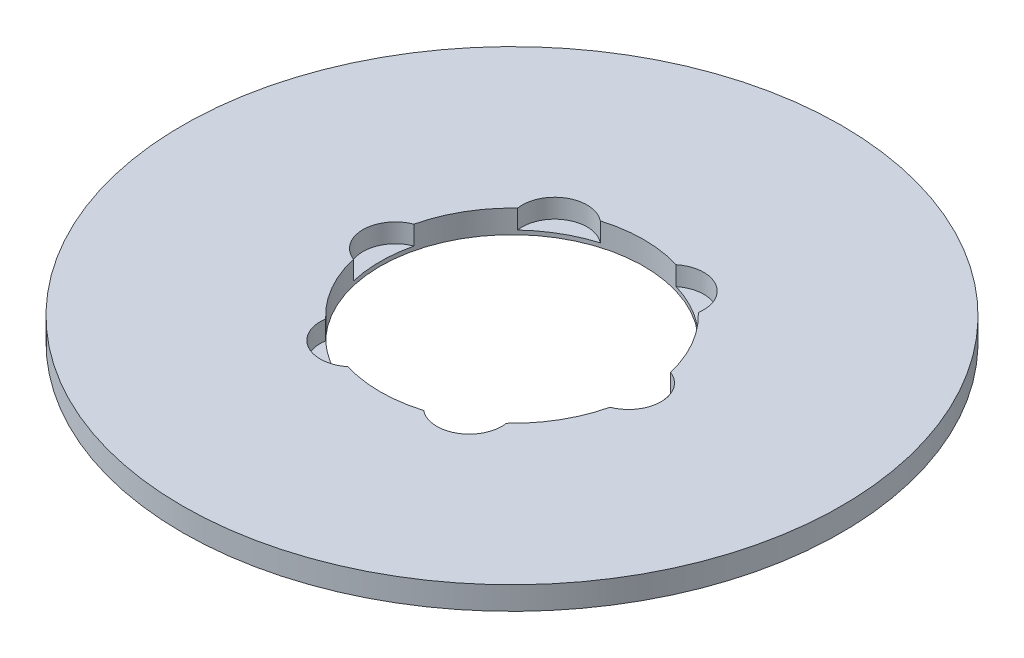
ISO-10303-21;
HEADER;
FILE_DESCRIPTION(('STEP AP214'),'2;1');
FILE_NAME('part.step','',(''),(''),'','','');
FILE_SCHEMA(('AUTOMOTIVE_DESIGN { 1 0 10303 214 1 1 1 1 }'));
ENDSEC;
DATA;
#1=APPLICATION_CONTEXT('core data for automotive mechanical design processes');
#2=APPLICATION_PROTOCOL_DEFINITION('international standard','automotive_design',2000,#1);
#3=PRODUCT_CONTEXT('',#1,'mechanical');
#4=PRODUCT('Part','Part','',(#3));
#5=PRODUCT_RELATED_PRODUCT_CATEGORY('part','',(#4));
#6=PRODUCT_DEFINITION_FORMATION('','',#4);
#7=PRODUCT_DEFINITION_CONTEXT('part definition',#1,'design');
#8=PRODUCT_DEFINITION('design','',#6,#7);
#9=PRODUCT_DEFINITION_SHAPE('','',#8);
#10=(LENGTH_UNIT() NAMED_UNIT(*) SI_UNIT(.MILLI.,.METRE.));
#11=(NAMED_UNIT(*) PLANE_ANGLE_UNIT() SI_UNIT($,.RADIAN.));
#12=(NAMED_UNIT(*) SI_UNIT($,.STERADIAN.) SOLID_ANGLE_UNIT());
#13=UNCERTAINTY_MEASURE_WITH_UNIT(LENGTH_MEASURE(1.E-05),#10,'distance_accuracy_value','');
#14=(GEOMETRIC_REPRESENTATION_CONTEXT(3) GLOBAL_UNCERTAINTY_ASSIGNED_CONTEXT((#13)) GLOBAL_UNIT_ASSIGNED_CONTEXT((#10,
#11,#12)) REPRESENTATION_CONTEXT('',''));
#15=CARTESIAN_POINT('',(0.,0.,0.));
#16=DIRECTION('',(0.,0.,1.));
#17=DIRECTION('',(1.,0.,0.));
#18=AXIS2_PLACEMENT_3D('',#15,#16,#17);
#19=CARTESIAN_POINT('',(0.,7.,0.));
#20=DIRECTION('',(0.,-1.,0.));
#21=DIRECTION('',(0.,0.,-1.));
#22=AXIS2_PLACEMENT_3D('',#19,#20,#21);
#23=CYLINDRICAL_SURFACE('',#22,100.);
#24=CARTESIAN_POINT('',(0.,7.,0.));
#25=DIRECTION('',(0.,1.,0.));
#26=DIRECTION('',(0.,0.,1.));
#27=AXIS2_PLACEMENT_3D('',#24,#25,#26);
#28=CIRCLE('',#27,100.);
#29=CARTESIAN_POINT('',(0.,7.,100.));
#30=VERTEX_POINT('',#29);
#31=EDGE_CURVE('E162',#30,#30,#28,.T.);
#32=ORIENTED_EDGE('',*,*,#31,.F.);
#33=EDGE_LOOP('',(#32));
#34=FACE_BOUND('',#33,.T.);
#35=CARTESIAN_POINT('',(0.,0.,0.));
#36=DIRECTION('',(0.,1.,0.));
#37=DIRECTION('',(0.,0.,1.));
#38=AXIS2_PLACEMENT_3D('',#35,#36,#37);
#39=CIRCLE('',#38,100.);
#40=CARTESIAN_POINT('',(0.,0.,100.));
#41=VERTEX_POINT('',#40);
#42=EDGE_CURVE('E157',#41,#41,#39,.T.);
#43=ORIENTED_EDGE('',*,*,#42,.T.);
#44=EDGE_LOOP('',(#43));
#45=FACE_BOUND('',#44,.T.);
#46=ADVANCED_FACE('F39',(#34,#45),#23,.T.);
#47=CARTESIAN_POINT('',(0.,7.,0.));
#48=DIRECTION('',(0.,1.,0.));
#49=DIRECTION('',(0.,0.,1.));
#50=AXIS2_PLACEMENT_3D('',#47,#48,#49);
#51=PLANE('',#50);
#52=CARTESIAN_POINT('',(-17.6937887469157,7.,-30.6465410880476));
#53=DIRECTION('',(0.,1.,0.));
#54=DIRECTION('',(-0.866025403784433,0.,0.50000000000001));
#55=AXIS2_PLACEMENT_3D('',#52,#53,#54);
#56=CIRCLE('',#55,9.84635689659921);
#57=CARTESIAN_POINT('',(-11.5094024887919,7.,-38.3084018767553));
#58=VERTEX_POINT('',#57);
#59=CARTESIAN_POINT('',(-27.4213479592583,7.,-29.1216358760507));
#60=VERTEX_POINT('',#59);
#61=EDGE_CURVE('E218',#58,#60,#56,.T.);
#62=ORIENTED_EDGE('',*,*,#61,.F.);
#63=CARTESIAN_POINT('',(0.,7.,0.));
#64=DIRECTION('',(0.,1.,0.));
#65=DIRECTION('',(0.,0.,1.));
#66=AXIS2_PLACEMENT_3D('',#63,#64,#65);
#67=CIRCLE('',#66,40.);
#68=CARTESIAN_POINT('',(11.5094024887911,7.,-38.3084018767555));
#69=VERTEX_POINT('',#68);
#70=EDGE_CURVE('E169',#69,#58,#67,.T.);
#71=ORIENTED_EDGE('',*,*,#70,.F.);
#72=CARTESIAN_POINT('',(17.693788746915,7.,-30.6465410880479));
#73=DIRECTION('',(0.,1.,0.));
#74=DIRECTION('',(-0.866025403784443,0.,-0.499999999999992));
#75=AXIS2_PLACEMENT_3D('',#72,#73,#74);
#76=CIRCLE('',#75,9.84635689659921);
#77=CARTESIAN_POINT('',(27.4213479592577,7.,-29.1216358760513));
#78=VERTEX_POINT('',#77);
#79=EDGE_CURVE('E285',#78,#69,#76,.T.);
#80=ORIENTED_EDGE('',*,*,#79,.F.);
#81=CARTESIAN_POINT('',(38.9307504480494,7.,-9.18676600070445));
#82=VERTEX_POINT('',#81);
#83=EDGE_CURVE('E174',#82,#78,#67,.T.);
#84=ORIENTED_EDGE('',*,*,#83,.F.);
#85=CARTESIAN_POINT('',(35.3875774938306,7.,0.));
#86=DIRECTION('',(0.,1.,0.));
#87=DIRECTION('',(0.,0.,-1.));
#88=AXIS2_PLACEMENT_3D('',#85,#86,#87);
#89=CIRCLE('',#88,9.84635689659921);
#90=CARTESIAN_POINT('',(38.9307504480494,7.,9.18676600070445));
#91=VERTEX_POINT('',#90);
#92=EDGE_CURVE('E280',#91,#82,#89,.T.);
#93=ORIENTED_EDGE('',*,*,#92,.F.);
#94=CARTESIAN_POINT('',(27.4213479592581,7.,29.1216358760509));
#95=VERTEX_POINT('',#94);
#96=EDGE_CURVE('E164',#95,#91,#67,.T.);
#97=ORIENTED_EDGE('',*,*,#96,.F.);
#98=CARTESIAN_POINT('',(17.6937887469155,7.,30.6465410880477));
#99=DIRECTION('',(0.,1.,0.));
#100=DIRECTION('',(0.866025403784436,0.,-0.500000000000004));
#101=AXIS2_PLACEMENT_3D('',#98,#99,#100);
#102=CIRCLE('',#101,9.84635689659921);
#103=CARTESIAN_POINT('',(11.5094024887917,7.,38.3084018767554));
#104=VERTEX_POINT('',#103);
#105=EDGE_CURVE('E269',#104,#95,#102,.T.);
#106=ORIENTED_EDGE('',*,*,#105,.F.);
#107=CARTESIAN_POINT('',(-11.5094024887914,7.,38.3084018767555));
#108=VERTEX_POINT('',#107);
#109=EDGE_CURVE('E149',#108,#104,#67,.T.);
#110=ORIENTED_EDGE('',*,*,#109,.F.);
#111=CARTESIAN_POINT('',(-17.6937887469152,7.,30.6465410880478));
#112=DIRECTION('',(0.,1.,0.));
#113=DIRECTION('',(0.86602540378444,0.,0.499999999999998));
#114=AXIS2_PLACEMENT_3D('',#111,#112,#113);
#115=CIRCLE('',#114,9.84635689659921);
#116=CARTESIAN_POINT('',(-27.4213479592579,7.,29.1216358760511));
#117=VERTEX_POINT('',#116);
#118=EDGE_CURVE('E128',#117,#108,#115,.T.);
#119=ORIENTED_EDGE('',*,*,#118,.F.);
#120=CARTESIAN_POINT('',(-38.9307504480494,7.,9.18676600070445));
#121=VERTEX_POINT('',#120);
#122=EDGE_CURVE('E148',#121,#117,#67,.T.);
#123=ORIENTED_EDGE('',*,*,#122,.F.);
#124=CARTESIAN_POINT('',(-35.3875774938306,7.,0.));
#125=DIRECTION('',(0.,1.,0.));
#126=DIRECTION('',(0.,0.,1.));
#127=AXIS2_PLACEMENT_3D('',#124,#125,#126);
#128=CIRCLE('',#127,9.84635689659921);
#129=CARTESIAN_POINT('',(-38.9307504480494,7.,-9.18676600070445));
#130=VERTEX_POINT('',#129);
#131=EDGE_CURVE('E179',#130,#121,#128,.T.);
#132=ORIENTED_EDGE('',*,*,#131,.F.);
#133=EDGE_CURVE('E161',#60,#130,#67,.T.);
#134=ORIENTED_EDGE('',*,*,#133,.F.);
#135=EDGE_LOOP('',(#62,#71,#80,#84,#93,#97,#106,#110,#119,#123,#132,#134));
#136=FACE_BOUND('',#135,.T.);
#137=ORIENTED_EDGE('',*,*,#31,.T.);
#138=EDGE_LOOP('',(#137));
#139=FACE_BOUND('',#138,.T.);
#140=ADVANCED_FACE('F141',(#136,#139),#51,.T.);
#141=CARTESIAN_POINT('',(0.,0.,0.));
#142=DIRECTION('',(0.,1.,0.));
#143=DIRECTION('',(0.,0.,1.));
#144=AXIS2_PLACEMENT_3D('',#141,#142,#143);
#145=PLANE('',#144);
#146=CARTESIAN_POINT('',(0.,0.,0.));
#147=DIRECTION('',(0.,1.,0.));
#148=DIRECTION('',(0.,0.,1.));
#149=AXIS2_PLACEMENT_3D('',#146,#147,#148);
#150=CIRCLE('',#149,40.);
#151=CARTESIAN_POINT('',(0.,0.,40.));
#152=VERTEX_POINT('',#151);
#153=EDGE_CURVE('E166',#152,#152,#150,.T.);
#154=ORIENTED_EDGE('',*,*,#153,.T.);
#155=EDGE_LOOP('',(#154));
#156=FACE_BOUND('',#155,.T.);
#157=ORIENTED_EDGE('',*,*,#42,.F.);
#158=EDGE_LOOP('',(#157));
#159=FACE_BOUND('',#158,.T.);
#160=ADVANCED_FACE('F234',(#156,#159),#145,.F.);
#161=CARTESIAN_POINT('',(0.,7.,0.));
#162=DIRECTION('',(0.,-1.,0.));
#163=DIRECTION('',(0.,0.,-1.));
#164=AXIS2_PLACEMENT_3D('',#161,#162,#163);
#165=CYLINDRICAL_SURFACE('',#164,40.);
#166=DIRECTION('',(0.,1.,0.));
#167=VECTOR('',#166,1.);
#168=CARTESIAN_POINT('',(-11.5094024887919,4.11774363589158,-38.3084018767553));
#169=LINE('',#168,#167);
#170=CARTESIAN_POINT('',(-11.5094024887919,1.23548727178315,-38.3084018767553));
#171=VERTEX_POINT('',#170);
#172=EDGE_CURVE('E11',#171,#58,#169,.T.);
#173=ORIENTED_EDGE('',*,*,#172,.F.);
#174=CARTESIAN_POINT('',(0.,1.23548727178315,0.));
#175=DIRECTION('',(0.,1.,0.));
#176=DIRECTION('',(0.,0.,1.));
#177=AXIS2_PLACEMENT_3D('',#174,#175,#176);
#178=CIRCLE('',#177,40.);
#179=CARTESIAN_POINT('',(-27.4213479592583,1.23548727178315,-29.1216358760507));
#180=VERTEX_POINT('',#179);
#181=EDGE_CURVE('E214',#171,#180,#178,.T.);
#182=ORIENTED_EDGE('',*,*,#181,.T.);
#183=DIRECTION('',(0.,1.,0.));
#184=VECTOR('',#183,1.);
#185=CARTESIAN_POINT('',(-27.4213479592583,4.11774363589158,-29.1216358760507));
#186=LINE('',#185,#184);
#187=EDGE_CURVE('E46',#60,#180,#186,.F.);
#188=ORIENTED_EDGE('',*,*,#187,.F.);
#189=ORIENTED_EDGE('',*,*,#133,.T.);
#190=DIRECTION('',(0.,1.,0.));
#191=VECTOR('',#190,1.);
#192=CARTESIAN_POINT('',(-38.9307504480494,4.11774363589158,-9.18676600070445));
#193=LINE('',#192,#191);
#194=CARTESIAN_POINT('',(-38.9307504480494,1.23548727178315,-9.18676600070445));
#195=VERTEX_POINT('',#194);
#196=EDGE_CURVE('E187',#195,#130,#193,.T.);
#197=ORIENTED_EDGE('',*,*,#196,.F.);
#198=CARTESIAN_POINT('',(0.,1.23548727178315,0.));
#199=DIRECTION('',(0.,1.,0.));
#200=DIRECTION('',(0.,0.,1.));
#201=AXIS2_PLACEMENT_3D('',#198,#199,#200);
#202=CIRCLE('',#201,40.);
#203=CARTESIAN_POINT('',(-38.9307504480494,1.23548727178315,9.18676600070445));
#204=VERTEX_POINT('',#203);
#205=EDGE_CURVE('E184',#195,#204,#202,.T.);
#206=ORIENTED_EDGE('',*,*,#205,.T.);
#207=DIRECTION('',(0.,1.,0.));
#208=VECTOR('',#207,1.);
#209=CARTESIAN_POINT('',(-38.9307504480494,4.11774363589158,9.18676600070445));
#210=LINE('',#209,#208);
#211=EDGE_CURVE('E158',#121,#204,#210,.F.);
#212=ORIENTED_EDGE('',*,*,#211,.F.);
#213=ORIENTED_EDGE('',*,*,#122,.T.);
#214=DIRECTION('',(0.,1.,0.));
#215=VECTOR('',#214,1.);
#216=CARTESIAN_POINT('',(-27.4213479592579,4.11774363589158,29.1216358760511));
#217=LINE('',#216,#215);
#218=CARTESIAN_POINT('',(-27.4213479592579,1.23548727178315,29.1216358760511));
#219=VERTEX_POINT('',#218);
#220=EDGE_CURVE('E127',#219,#117,#217,.T.);
#221=ORIENTED_EDGE('',*,*,#220,.F.);
#222=CARTESIAN_POINT('',(0.,1.23548727178315,0.));
#223=DIRECTION('',(0.,1.,0.));
#224=DIRECTION('',(0.,0.,1.));
#225=AXIS2_PLACEMENT_3D('',#222,#223,#224);
#226=CIRCLE('',#225,40.);
#227=CARTESIAN_POINT('',(-11.5094024887914,1.23548727178315,38.3084018767555));
#228=VERTEX_POINT('',#227);
#229=EDGE_CURVE('E189',#219,#228,#226,.T.);
#230=ORIENTED_EDGE('',*,*,#229,.T.);
#231=DIRECTION('',(0.,1.,0.));
#232=VECTOR('',#231,1.);
#233=CARTESIAN_POINT('',(-11.5094024887914,4.11774363589158,38.3084018767555));
#234=LINE('',#233,#232);
#235=EDGE_CURVE('E140',#108,#228,#234,.F.);
#236=ORIENTED_EDGE('',*,*,#235,.F.);
#237=ORIENTED_EDGE('',*,*,#109,.T.);
#238=DIRECTION('',(0.,1.,0.));
#239=VECTOR('',#238,1.);
#240=CARTESIAN_POINT('',(11.5094024887917,4.11774363589158,38.3084018767554));
#241=LINE('',#240,#239);
#242=CARTESIAN_POINT('',(11.5094024887917,1.23548727178315,38.3084018767554));
#243=VERTEX_POINT('',#242);
#244=EDGE_CURVE('E196',#243,#104,#241,.T.);
#245=ORIENTED_EDGE('',*,*,#244,.F.);
#246=CARTESIAN_POINT('',(0.,1.23548727178315,0.));
#247=DIRECTION('',(0.,1.,0.));
#248=DIRECTION('',(0.,0.,1.));
#249=AXIS2_PLACEMENT_3D('',#246,#247,#248);
#250=CIRCLE('',#249,40.);
#251=CARTESIAN_POINT('',(27.4213479592581,1.23548727178315,29.1216358760509));
#252=VERTEX_POINT('',#251);
#253=EDGE_CURVE('E136',#243,#252,#250,.T.);
#254=ORIENTED_EDGE('',*,*,#253,.T.);
#255=DIRECTION('',(0.,1.,0.));
#256=VECTOR('',#255,1.);
#257=CARTESIAN_POINT('',(27.4213479592581,4.11774363589158,29.1216358760509));
#258=LINE('',#257,#256);
#259=EDGE_CURVE('E194',#95,#252,#258,.F.);
#260=ORIENTED_EDGE('',*,*,#259,.F.);
#261=ORIENTED_EDGE('',*,*,#96,.T.);
#262=DIRECTION('',(0.,1.,0.));
#263=VECTOR('',#262,1.);
#264=CARTESIAN_POINT('',(38.9307504480494,4.11774363589158,9.18676600070445));
#265=LINE('',#264,#263);
#266=CARTESIAN_POINT('',(38.9307504480494,1.23548727178315,9.18676600070445));
#267=VERTEX_POINT('',#266);
#268=EDGE_CURVE('E206',#267,#91,#265,.T.);
#269=ORIENTED_EDGE('',*,*,#268,.F.);
#270=CARTESIAN_POINT('',(0.,1.23548727178315,0.));
#271=DIRECTION('',(0.,1.,0.));
#272=DIRECTION('',(0.,0.,1.));
#273=AXIS2_PLACEMENT_3D('',#270,#271,#272);
#274=CIRCLE('',#273,40.);
#275=CARTESIAN_POINT('',(38.9307504480494,1.23548727178315,-9.18676600070445));
#276=VERTEX_POINT('',#275);
#277=EDGE_CURVE('E199',#267,#276,#274,.T.);
#278=ORIENTED_EDGE('',*,*,#277,.T.);
#279=DIRECTION('',(0.,1.,0.));
#280=VECTOR('',#279,1.);
#281=CARTESIAN_POINT('',(38.9307504480494,4.11774363589158,-9.18676600070445));
#282=LINE('',#281,#280);
#283=EDGE_CURVE('E201',#82,#276,#282,.F.);
#284=ORIENTED_EDGE('',*,*,#283,.F.);
#285=ORIENTED_EDGE('',*,*,#83,.T.);
#286=DIRECTION('',(0.,1.,0.));
#287=VECTOR('',#286,1.);
#288=CARTESIAN_POINT('',(27.4213479592577,4.11774363589158,-29.1216358760513));
#289=LINE('',#288,#287);
#290=CARTESIAN_POINT('',(27.4213479592577,1.23548727178315,-29.1216358760513));
#291=VERTEX_POINT('',#290);
#292=EDGE_CURVE('E213',#291,#78,#289,.T.);
#293=ORIENTED_EDGE('',*,*,#292,.F.);
#294=CARTESIAN_POINT('',(0.,1.23548727178315,0.));
#295=DIRECTION('',(0.,1.,0.));
#296=DIRECTION('',(0.,0.,1.));
#297=AXIS2_PLACEMENT_3D('',#294,#295,#296);
#298=CIRCLE('',#297,40.);
#299=CARTESIAN_POINT('',(11.5094024887911,1.23548727178315,-38.3084018767555));
#300=VERTEX_POINT('',#299);
#301=EDGE_CURVE('E208',#291,#300,#298,.T.);
#302=ORIENTED_EDGE('',*,*,#301,.T.);
#303=DIRECTION('',(0.,1.,0.));
#304=VECTOR('',#303,1.);
#305=CARTESIAN_POINT('',(11.5094024887911,4.11774363589158,-38.3084018767556));
#306=LINE('',#305,#304);
#307=EDGE_CURVE('E211',#69,#300,#306,.F.);
#308=ORIENTED_EDGE('',*,*,#307,.F.);
#309=ORIENTED_EDGE('',*,*,#70,.T.);
#310=EDGE_LOOP('',(#173,#182,#188,#189,#197,#206,#212,#213,#221,#230,#236,#237,#245,#254,#260,
#261,#269,#278,#284,#285,#293,#302,#308,#309));
#311=FACE_BOUND('',#310,.T.);
#312=ORIENTED_EDGE('',*,*,#153,.F.);
#313=EDGE_LOOP('',(#312));
#314=FACE_BOUND('',#313,.T.);
#315=ADVANCED_FACE('F152',(#311,#314),#165,.F.);
#316=CARTESIAN_POINT('',(-35.3875774938306,1.23548727178315,0.));
#317=DIRECTION('',(0.,1.,0.));
#318=DIRECTION('',(0.,0.,1.));
#319=AXIS2_PLACEMENT_3D('',#316,#317,#318);
#320=CYLINDRICAL_SURFACE('',#319,9.84635689659921);
#321=ORIENTED_EDGE('',*,*,#196,.T.);
#322=ORIENTED_EDGE('',*,*,#131,.T.);
#323=ORIENTED_EDGE('',*,*,#211,.T.);
#324=CARTESIAN_POINT('',(-35.3875774938306,1.23548727178315,0.));
#325=DIRECTION('',(0.,1.,0.));
#326=DIRECTION('',(0.,0.,1.));
#327=AXIS2_PLACEMENT_3D('',#324,#325,#326);
#328=CIRCLE('',#327,9.84635689659921);
#329=EDGE_CURVE('E180',#195,#204,#328,.T.);
#330=ORIENTED_EDGE('',*,*,#329,.F.);
#331=EDGE_LOOP('',(#321,#322,#323,#330));
#332=FACE_BOUND('',#331,.T.);
#333=ADVANCED_FACE('F244',(#332),#320,.F.);
#334=CARTESIAN_POINT('',(-35.3875774938306,1.23548727178315,0.));
#335=DIRECTION('',(0.,1.,0.));
#336=DIRECTION('',(0.,0.,1.));
#337=AXIS2_PLACEMENT_3D('',#334,#335,#336);
#338=PLANE('',#337);
#339=ORIENTED_EDGE('',*,*,#329,.T.);
#340=ORIENTED_EDGE('',*,*,#205,.F.);
#341=EDGE_LOOP('',(#339,#340));
#342=FACE_BOUND('',#341,.T.);
#343=ADVANCED_FACE('F248',(#342),#338,.T.);
#344=CARTESIAN_POINT('',(-17.6937887469152,1.23548727178315,30.6465410880478));
#345=DIRECTION('',(0.,1.,0.));
#346=DIRECTION('',(0.,0.,1.));
#347=AXIS2_PLACEMENT_3D('',#344,#345,#346);
#348=CYLINDRICAL_SURFACE('',#347,9.84635689659921);
#349=ORIENTED_EDGE('',*,*,#220,.T.);
#350=ORIENTED_EDGE('',*,*,#118,.T.);
#351=ORIENTED_EDGE('',*,*,#235,.T.);
#352=CARTESIAN_POINT('',(-17.6937887469152,1.23548727178315,30.6465410880478));
#353=DIRECTION('',(0.,1.,0.));
#354=DIRECTION('',(0.86602540378444,0.,0.499999999999998));
#355=AXIS2_PLACEMENT_3D('',#352,#353,#354);
#356=CIRCLE('',#355,9.84635689659921);
#357=EDGE_CURVE('E135',#219,#228,#356,.T.);
#358=ORIENTED_EDGE('',*,*,#357,.F.);
#359=EDGE_LOOP('',(#349,#350,#351,#358));
#360=FACE_BOUND('',#359,.T.);
#361=ADVANCED_FACE('F126',(#360),#348,.F.);
#362=CARTESIAN_POINT('',(-17.6937887469152,1.23548727178315,30.6465410880478));
#363=DIRECTION('',(0.,1.,0.));
#364=DIRECTION('',(0.86602540378444,0.,0.499999999999998));
#365=AXIS2_PLACEMENT_3D('',#362,#363,#364);
#366=PLANE('',#365);
#367=ORIENTED_EDGE('',*,*,#357,.T.);
#368=ORIENTED_EDGE('',*,*,#229,.F.);
#369=EDGE_LOOP('',(#367,#368));
#370=FACE_BOUND('',#369,.T.);
#371=ADVANCED_FACE('F258',(#370),#366,.T.);
#372=CARTESIAN_POINT('',(17.6937887469155,1.23548727178315,30.6465410880477));
#373=DIRECTION('',(0.,1.,0.));
#374=DIRECTION('',(0.,0.,1.));
#375=AXIS2_PLACEMENT_3D('',#372,#373,#374);
#376=CYLINDRICAL_SURFACE('',#375,9.84635689659921);
#377=ORIENTED_EDGE('',*,*,#244,.T.);
#378=ORIENTED_EDGE('',*,*,#105,.T.);
#379=ORIENTED_EDGE('',*,*,#259,.T.);
#380=CARTESIAN_POINT('',(17.6937887469155,1.23548727178315,30.6465410880477));
#381=DIRECTION('',(0.,1.,0.));
#382=DIRECTION('',(0.866025403784436,0.,-0.500000000000004));
#383=AXIS2_PLACEMENT_3D('',#380,#381,#382);
#384=CIRCLE('',#383,9.84635689659921);
#385=EDGE_CURVE('E147',#243,#252,#384,.T.);
#386=ORIENTED_EDGE('',*,*,#385,.F.);
#387=EDGE_LOOP('',(#377,#378,#379,#386));
#388=FACE_BOUND('',#387,.T.);
#389=ADVANCED_FACE('F256',(#388),#376,.F.);
#390=CARTESIAN_POINT('',(17.6937887469155,1.23548727178315,30.6465410880477));
#391=DIRECTION('',(0.,1.,0.));
#392=DIRECTION('',(0.866025403784436,0.,-0.500000000000004));
#393=AXIS2_PLACEMENT_3D('',#390,#391,#392);
#394=PLANE('',#393);
#395=ORIENTED_EDGE('',*,*,#385,.T.);
#396=ORIENTED_EDGE('',*,*,#253,.F.);
#397=EDGE_LOOP('',(#395,#396));
#398=FACE_BOUND('',#397,.T.);
#399=ADVANCED_FACE('F263',(#398),#394,.T.);
#400=CARTESIAN_POINT('',(35.3875774938306,1.23548727178315,0.));
#401=DIRECTION('',(0.,1.,0.));
#402=DIRECTION('',(0.,0.,1.));
#403=AXIS2_PLACEMENT_3D('',#400,#401,#402);
#404=CYLINDRICAL_SURFACE('',#403,9.84635689659921);
#405=ORIENTED_EDGE('',*,*,#268,.T.);
#406=ORIENTED_EDGE('',*,*,#92,.T.);
#407=ORIENTED_EDGE('',*,*,#283,.T.);
#408=CARTESIAN_POINT('',(35.3875774938306,1.23548727178315,0.));
#409=DIRECTION('',(0.,1.,0.));
#410=DIRECTION('',(0.,0.,-1.));
#411=AXIS2_PLACEMENT_3D('',#408,#409,#410);
#412=CIRCLE('',#411,9.84635689659921);
#413=EDGE_CURVE('E273',#267,#276,#412,.T.);
#414=ORIENTED_EDGE('',*,*,#413,.F.);
#415=EDGE_LOOP('',(#405,#406,#407,#414));
#416=FACE_BOUND('',#415,.T.);
#417=ADVANCED_FACE('F297',(#416),#404,.F.);
#418=CARTESIAN_POINT('',(35.3875774938306,1.23548727178315,0.));
#419=DIRECTION('',(0.,1.,0.));
#420=DIRECTION('',(0.,0.,-1.));
#421=AXIS2_PLACEMENT_3D('',#418,#419,#420);
#422=PLANE('',#421);
#423=ORIENTED_EDGE('',*,*,#413,.T.);
#424=ORIENTED_EDGE('',*,*,#277,.F.);
#425=EDGE_LOOP('',(#423,#424));
#426=FACE_BOUND('',#425,.T.);
#427=ADVANCED_FACE('F299',(#426),#422,.T.);
#428=CARTESIAN_POINT('',(17.693788746915,1.23548727178315,-30.6465410880479));
#429=DIRECTION('',(0.,1.,0.));
#430=DIRECTION('',(0.,0.,1.));
#431=AXIS2_PLACEMENT_3D('',#428,#429,#430);
#432=CYLINDRICAL_SURFACE('',#431,9.84635689659921);
#433=ORIENTED_EDGE('',*,*,#292,.T.);
#434=ORIENTED_EDGE('',*,*,#79,.T.);
#435=ORIENTED_EDGE('',*,*,#307,.T.);
#436=CARTESIAN_POINT('',(17.693788746915,1.23548727178315,-30.6465410880479));
#437=DIRECTION('',(0.,1.,0.));
#438=DIRECTION('',(-0.866025403784443,0.,-0.499999999999992));
#439=AXIS2_PLACEMENT_3D('',#436,#437,#438);
#440=CIRCLE('',#439,9.84635689659921);
#441=EDGE_CURVE('E56',#291,#300,#440,.T.);
#442=ORIENTED_EDGE('',*,*,#441,.F.);
#443=EDGE_LOOP('',(#433,#434,#435,#442));
#444=FACE_BOUND('',#443,.T.);
#445=ADVANCED_FACE('F292',(#444),#432,.F.);
#446=CARTESIAN_POINT('',(17.693788746915,1.23548727178315,-30.6465410880479));
#447=DIRECTION('',(0.,1.,0.));
#448=DIRECTION('',(-0.866025403784443,0.,-0.499999999999992));
#449=AXIS2_PLACEMENT_3D('',#446,#447,#448);
#450=PLANE('',#449);
#451=ORIENTED_EDGE('',*,*,#441,.T.);
#452=ORIENTED_EDGE('',*,*,#301,.F.);
#453=EDGE_LOOP('',(#451,#452));
#454=FACE_BOUND('',#453,.T.);
#455=ADVANCED_FACE('F226',(#454),#450,.T.);
#456=CARTESIAN_POINT('',(-17.6937887469157,1.23548727178315,-30.6465410880476));
#457=DIRECTION('',(0.,1.,0.));
#458=DIRECTION('',(0.,0.,1.));
#459=AXIS2_PLACEMENT_3D('',#456,#457,#458);
#460=CYLINDRICAL_SURFACE('',#459,9.84635689659921);
#461=ORIENTED_EDGE('',*,*,#172,.T.);
#462=ORIENTED_EDGE('',*,*,#61,.T.);
#463=ORIENTED_EDGE('',*,*,#187,.T.);
#464=CARTESIAN_POINT('',(-17.6937887469157,1.23548727178315,-30.6465410880476));
#465=DIRECTION('',(0.,1.,0.));
#466=DIRECTION('',(-0.866025403784433,0.,0.50000000000001));
#467=AXIS2_PLACEMENT_3D('',#464,#465,#466);
#468=CIRCLE('',#467,9.84635689659921);
#469=EDGE_CURVE('E55',#171,#180,#468,.T.);
#470=ORIENTED_EDGE('',*,*,#469,.F.);
#471=EDGE_LOOP('',(#461,#462,#463,#470));
#472=FACE_BOUND('',#471,.T.);
#473=ADVANCED_FACE('F217',(#472),#460,.F.);
#474=CARTESIAN_POINT('',(-17.6937887469157,1.23548727178315,-30.6465410880476));
#475=DIRECTION('',(0.,1.,0.));
#476=DIRECTION('',(-0.866025403784433,0.,0.50000000000001));
#477=AXIS2_PLACEMENT_3D('',#474,#475,#476);
#478=PLANE('',#477);
#479=ORIENTED_EDGE('',*,*,#469,.T.);
#480=ORIENTED_EDGE('',*,*,#181,.F.);
#481=EDGE_LOOP('',(#479,#480));
#482=FACE_BOUND('',#481,.T.);
#483=ADVANCED_FACE('F219',(#482),#478,.T.);
#484=CLOSED_SHELL('',(#46,#140,#160,#315,#333,#343,#361,#371,#389,#399,#417,#427,#445,#455,#473,#483));
#485=MANIFOLD_SOLID_BREP('B2',#484);
#486=ADVANCED_BREP_SHAPE_REPRESENTATION('',(#18,#485),#14);
#487=SHAPE_DEFINITION_REPRESENTATION(#9,#486);
ENDSEC;
END-ISO-10303-21;
